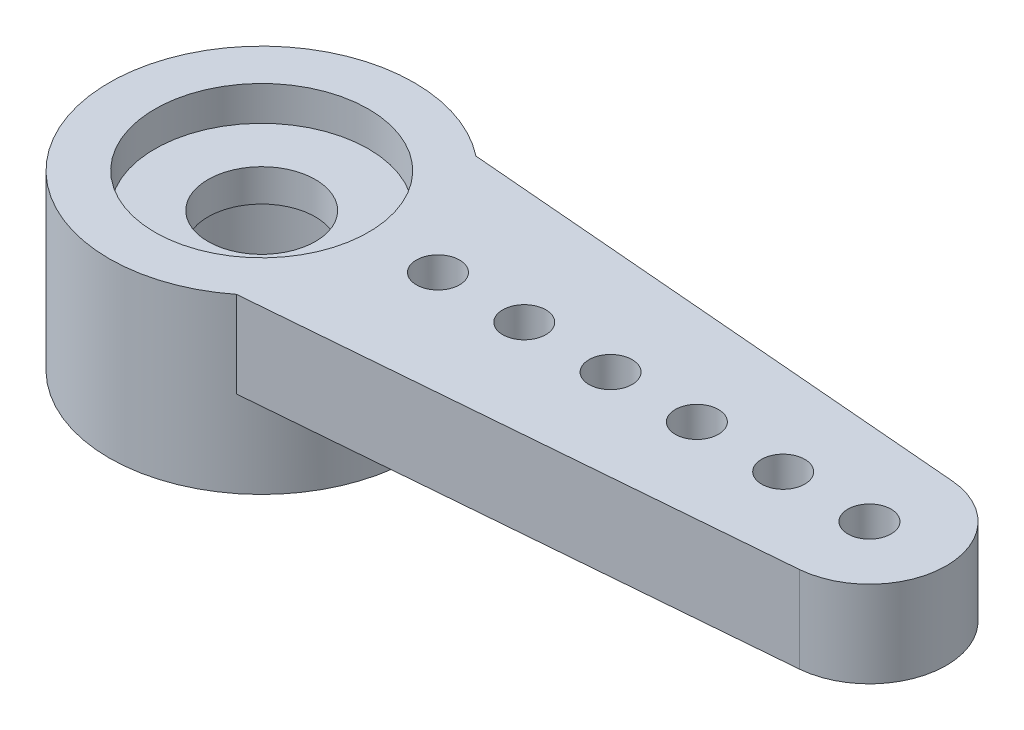
ISO-10303-21;
HEADER;
FILE_DESCRIPTION(('STEP AP214'),'2;1');
FILE_NAME('part.step','',(''),(''),'','','');
FILE_SCHEMA(('AUTOMOTIVE_DESIGN { 1 0 10303 214 1 1 1 1 }'));
ENDSEC;
DATA;
#1=APPLICATION_CONTEXT('core data for automotive mechanical design processes');
#2=APPLICATION_PROTOCOL_DEFINITION('international standard','automotive_design',2000,#1);
#3=PRODUCT_CONTEXT('',#1,'mechanical');
#4=PRODUCT('Part','Part','',(#3));
#5=PRODUCT_RELATED_PRODUCT_CATEGORY('part','',(#4));
#6=PRODUCT_DEFINITION_FORMATION('','',#4);
#7=PRODUCT_DEFINITION_CONTEXT('part definition',#1,'design');
#8=PRODUCT_DEFINITION('design','',#6,#7);
#9=PRODUCT_DEFINITION_SHAPE('','',#8);
#10=(LENGTH_UNIT() NAMED_UNIT(*) SI_UNIT(.MILLI.,.METRE.));
#11=(NAMED_UNIT(*) PLANE_ANGLE_UNIT() SI_UNIT($,.RADIAN.));
#12=(NAMED_UNIT(*) SI_UNIT($,.STERADIAN.) SOLID_ANGLE_UNIT());
#13=UNCERTAINTY_MEASURE_WITH_UNIT(LENGTH_MEASURE(1.E-05),#10,'distance_accuracy_value','');
#14=(GEOMETRIC_REPRESENTATION_CONTEXT(3) GLOBAL_UNCERTAINTY_ASSIGNED_CONTEXT((#13)) GLOBAL_UNIT_ASSIGNED_CONTEXT((#10,
#11,#12)) REPRESENTATION_CONTEXT('',''));
#15=CARTESIAN_POINT('',(0.,0.,0.));
#16=DIRECTION('',(0.,0.,1.));
#17=DIRECTION('',(1.,0.,0.));
#18=AXIS2_PLACEMENT_3D('',#15,#16,#17);
#19=CARTESIAN_POINT('',(0.,55.,0.));
#20=DIRECTION('',(0.,1.,0.));
#21=DIRECTION('',(0.,0.,1.));
#22=AXIS2_PLACEMENT_3D('',#19,#20,#21);
#23=CYLINDRICAL_SURFACE('',#22,3.535);
#24=CARTESIAN_POINT('',(0.,-2.,0.));
#25=DIRECTION('',(0.,1.,0.));
#26=DIRECTION('',(0.,0.,1.));
#27=AXIS2_PLACEMENT_3D('',#24,#25,#26);
#28=CIRCLE('',#27,3.535);
#29=CARTESIAN_POINT('',(0.,-2.,3.535));
#30=VERTEX_POINT('',#29);
#31=EDGE_CURVE('E150',#30,#30,#28,.T.);
#32=ORIENTED_EDGE('',*,*,#31,.T.);
#33=EDGE_LOOP('',(#32));
#34=FACE_BOUND('',#33,.T.);
#35=DIRECTION('',(0.,-1.,0.));
#36=VECTOR('',#35,1.);
#37=CARTESIAN_POINT('',(2.18988584177349,15.9538300204828,-2.775));
#38=LINE('',#37,#36);
#39=CARTESIAN_POINT('',(2.18988584177349,2.,-2.775));
#40=VERTEX_POINT('',#39);
#41=CARTESIAN_POINT('',(2.18988584177349,0.,-2.775));
#42=VERTEX_POINT('',#41);
#43=EDGE_CURVE('E96',#40,#42,#38,.T.);
#44=ORIENTED_EDGE('',*,*,#43,.T.);
#45=CARTESIAN_POINT('',(0.,0.,0.));
#46=DIRECTION('',(0.,1.,0.));
#47=DIRECTION('',(0.,0.,1.));
#48=AXIS2_PLACEMENT_3D('',#45,#46,#47);
#49=CIRCLE('',#48,3.535);
#50=CARTESIAN_POINT('',(2.18988584177349,0.,2.775));
#51=VERTEX_POINT('',#50);
#52=EDGE_CURVE('E101',#51,#42,#49,.T.);
#53=ORIENTED_EDGE('',*,*,#52,.F.);
#54=DIRECTION('',(0.,-1.,0.));
#55=VECTOR('',#54,1.);
#56=CARTESIAN_POINT('',(2.18988584177349,15.9538300204828,2.775));
#57=LINE('',#56,#55);
#58=CARTESIAN_POINT('',(2.18988584177349,2.,2.775));
#59=VERTEX_POINT('',#58);
#60=EDGE_CURVE('E110',#59,#51,#57,.T.);
#61=ORIENTED_EDGE('',*,*,#60,.F.);
#62=CARTESIAN_POINT('',(0.,2.,0.));
#63=DIRECTION('',(0.,1.,0.));
#64=DIRECTION('',(0.,0.,1.));
#65=AXIS2_PLACEMENT_3D('',#62,#63,#64);
#66=CIRCLE('',#65,3.535);
#67=EDGE_CURVE('E56',#40,#59,#66,.T.);
#68=ORIENTED_EDGE('',*,*,#67,.F.);
#69=EDGE_LOOP('',(#44,#53,#61,#68));
#70=FACE_BOUND('',#69,.T.);
#71=ADVANCED_FACE('F36',(#34,#70),#23,.T.);
#72=CARTESIAN_POINT('',(3.535,2.,0.));
#73=DIRECTION('',(0.,-1.,0.));
#74=DIRECTION('',(0.,0.,-1.));
#75=AXIS2_PLACEMENT_3D('',#72,#73,#74);
#76=PLANE('',#75);
#77=DIRECTION('',(-0.996562375684888,0.,-0.0828458289190973));
#78=VECTOR('',#77,1.);
#79=CARTESIAN_POINT('',(0.244137006312476,2.,-2.93675322195096));
#80=LINE('',#79,#78);
#81=CARTESIAN_POINT('',(14.232465575476,2.,-1.7738810287191));
#82=VERTEX_POINT('',#81);
#83=EDGE_CURVE('E95',#82,#40,#80,.T.);
#84=ORIENTED_EDGE('',*,*,#83,.T.);
#85=ORIENTED_EDGE('',*,*,#67,.T.);
#86=DIRECTION('',(-0.996562375684888,0.,0.0828458289190973));
#87=VECTOR('',#86,1.);
#88=CARTESIAN_POINT('',(0.244137006312476,2.,2.93675322195096));
#89=LINE('',#88,#87);
#90=CARTESIAN_POINT('',(14.232465575476,2.,1.7738810287191));
#91=VERTEX_POINT('',#90);
#92=EDGE_CURVE('E51',#91,#59,#89,.T.);
#93=ORIENTED_EDGE('',*,*,#92,.F.);
#94=CARTESIAN_POINT('',(14.085,2.,0.));
#95=DIRECTION('',(0.,-1.,0.));
#96=DIRECTION('',(0.,0.,-1.));
#97=AXIS2_PLACEMENT_3D('',#94,#95,#96);
#98=CIRCLE('',#97,1.78);
#99=EDGE_CURVE('E122',#82,#91,#98,.T.);
#100=ORIENTED_EDGE('',*,*,#99,.F.);
#101=EDGE_LOOP('',(#84,#85,#93,#100));
#102=FACE_BOUND('',#101,.T.);
#103=CARTESIAN_POINT('',(14.085,2.,0.));
#104=DIRECTION('',(0.,-1.,0.));
#105=DIRECTION('',(0.,0.,-1.));
#106=AXIS2_PLACEMENT_3D('',#103,#104,#105);
#107=CIRCLE('',#106,0.500000000000001);
#108=CARTESIAN_POINT('',(14.085,2.,-0.500000000000001));
#109=VERTEX_POINT('',#108);
#110=EDGE_CURVE('E119',#109,#109,#107,.T.);
#111=ORIENTED_EDGE('',*,*,#110,.T.);
#112=EDGE_LOOP('',(#111));
#113=FACE_BOUND('',#112,.T.);
#114=CARTESIAN_POINT('',(12.085,2.,0.));
#115=DIRECTION('',(0.,-1.,0.));
#116=DIRECTION('',(0.,0.,-1.));
#117=AXIS2_PLACEMENT_3D('',#114,#115,#116);
#118=CIRCLE('',#117,0.500000000000001);
#119=CARTESIAN_POINT('',(12.085,2.,-0.499999999999987));
#120=VERTEX_POINT('',#119);
#121=EDGE_CURVE('E116',#120,#120,#118,.T.);
#122=ORIENTED_EDGE('',*,*,#121,.T.);
#123=EDGE_LOOP('',(#122));
#124=FACE_BOUND('',#123,.T.);
#125=CARTESIAN_POINT('',(10.085,2.,0.));
#126=DIRECTION('',(0.,-1.,0.));
#127=DIRECTION('',(0.,0.,-1.));
#128=AXIS2_PLACEMENT_3D('',#125,#126,#127);
#129=CIRCLE('',#128,0.500000000000001);
#130=CARTESIAN_POINT('',(10.085,2.,-0.499999999999973));
#131=VERTEX_POINT('',#130);
#132=EDGE_CURVE('E113',#131,#131,#129,.T.);
#133=ORIENTED_EDGE('',*,*,#132,.T.);
#134=EDGE_LOOP('',(#133));
#135=FACE_BOUND('',#134,.T.);
#136=CARTESIAN_POINT('',(8.085,2.,0.));
#137=DIRECTION('',(0.,-1.,0.));
#138=DIRECTION('',(0.,0.,-1.));
#139=AXIS2_PLACEMENT_3D('',#136,#137,#138);
#140=CIRCLE('',#139,0.500000000000001);
#141=CARTESIAN_POINT('',(8.085,2.,-0.499999999999959));
#142=VERTEX_POINT('',#141);
#143=EDGE_CURVE('E109',#142,#142,#140,.T.);
#144=ORIENTED_EDGE('',*,*,#143,.T.);
#145=EDGE_LOOP('',(#144));
#146=FACE_BOUND('',#145,.T.);
#147=CARTESIAN_POINT('',(6.085,2.,0.));
#148=DIRECTION('',(0.,-1.,0.));
#149=DIRECTION('',(0.,0.,-1.));
#150=AXIS2_PLACEMENT_3D('',#147,#148,#149);
#151=CIRCLE('',#150,0.500000000000001);
#152=CARTESIAN_POINT('',(6.085,2.,-0.499999999999945));
#153=VERTEX_POINT('',#152);
#154=EDGE_CURVE('E106',#153,#153,#151,.T.);
#155=ORIENTED_EDGE('',*,*,#154,.T.);
#156=EDGE_LOOP('',(#155));
#157=FACE_BOUND('',#156,.T.);
#158=CARTESIAN_POINT('',(0.,2.,0.));
#159=DIRECTION('',(0.,1.,0.));
#160=DIRECTION('',(0.,0.,1.));
#161=AXIS2_PLACEMENT_3D('',#158,#159,#160);
#162=CIRCLE('',#161,2.475);
#163=CARTESIAN_POINT('',(0.,2.,2.475));
#164=VERTEX_POINT('',#163);
#165=EDGE_CURVE('E11',#164,#164,#162,.T.);
#166=ORIENTED_EDGE('',*,*,#165,.F.);
#167=EDGE_LOOP('',(#166));
#168=FACE_BOUND('',#167,.T.);
#169=CARTESIAN_POINT('',(4.085,2.,0.));
#170=DIRECTION('',(0.,-1.,0.));
#171=DIRECTION('',(0.,0.,-1.));
#172=AXIS2_PLACEMENT_3D('',#169,#170,#171);
#173=CIRCLE('',#172,0.500000000000001);
#174=CARTESIAN_POINT('',(4.085,2.,-0.499999999999931));
#175=VERTEX_POINT('',#174);
#176=EDGE_CURVE('E125',#175,#175,#173,.T.);
#177=ORIENTED_EDGE('',*,*,#176,.T.);
#178=EDGE_LOOP('',(#177));
#179=FACE_BOUND('',#178,.T.);
#180=ADVANCED_FACE('F38',(#102,#113,#124,#135,#146,#157,#168,#179),#76,.F.);
#181=CARTESIAN_POINT('',(0.,55.,0.));
#182=DIRECTION('',(0.,1.,0.));
#183=DIRECTION('',(0.,0.,1.));
#184=AXIS2_PLACEMENT_3D('',#181,#182,#183);
#185=CYLINDRICAL_SURFACE('',#184,2.475);
#186=CARTESIAN_POINT('',(0.,1.2,0.));
#187=DIRECTION('',(0.,1.,0.));
#188=DIRECTION('',(0.,0.,1.));
#189=AXIS2_PLACEMENT_3D('',#186,#187,#188);
#190=CIRCLE('',#189,2.475);
#191=CARTESIAN_POINT('',(0.,1.2,2.475));
#192=VERTEX_POINT('',#191);
#193=EDGE_CURVE('E44',#192,#192,#190,.T.);
#194=ORIENTED_EDGE('',*,*,#193,.F.);
#195=EDGE_LOOP('',(#194));
#196=FACE_BOUND('',#195,.T.);
#197=ORIENTED_EDGE('',*,*,#165,.T.);
#198=EDGE_LOOP('',(#197));
#199=FACE_BOUND('',#198,.T.);
#200=ADVANCED_FACE('F169',(#196,#199),#185,.F.);
#201=CARTESIAN_POINT('',(2.475,1.2,0.));
#202=DIRECTION('',(0.,-1.,0.));
#203=DIRECTION('',(0.,0.,-1.));
#204=AXIS2_PLACEMENT_3D('',#201,#202,#203);
#205=PLANE('',#204);
#206=CARTESIAN_POINT('',(0.,1.2,0.));
#207=DIRECTION('',(0.,1.,0.));
#208=DIRECTION('',(0.,0.,1.));
#209=AXIS2_PLACEMENT_3D('',#206,#207,#208);
#210=CIRCLE('',#209,1.245);
#211=CARTESIAN_POINT('',(0.,1.2,1.245));
#212=VERTEX_POINT('',#211);
#213=EDGE_CURVE('E162',#212,#212,#210,.T.);
#214=ORIENTED_EDGE('',*,*,#213,.F.);
#215=EDGE_LOOP('',(#214));
#216=FACE_BOUND('',#215,.T.);
#217=ORIENTED_EDGE('',*,*,#193,.T.);
#218=EDGE_LOOP('',(#217));
#219=FACE_BOUND('',#218,.T.);
#220=ADVANCED_FACE('F167',(#216,#219),#205,.F.);
#221=CARTESIAN_POINT('',(0.,55.,0.));
#222=DIRECTION('',(0.,1.,0.));
#223=DIRECTION('',(0.,0.,1.));
#224=AXIS2_PLACEMENT_3D('',#221,#222,#223);
#225=CYLINDRICAL_SURFACE('',#224,1.245);
#226=CARTESIAN_POINT('',(0.,0.449999999999999,0.));
#227=DIRECTION('',(0.,1.,0.));
#228=DIRECTION('',(0.,0.,1.));
#229=AXIS2_PLACEMENT_3D('',#226,#227,#228);
#230=CIRCLE('',#229,1.245);
#231=CARTESIAN_POINT('',(0.,0.449999999999999,1.245));
#232=VERTEX_POINT('',#231);
#233=EDGE_CURVE('E159',#232,#232,#230,.T.);
#234=ORIENTED_EDGE('',*,*,#233,.F.);
#235=EDGE_LOOP('',(#234));
#236=FACE_BOUND('',#235,.T.);
#237=ORIENTED_EDGE('',*,*,#213,.T.);
#238=EDGE_LOOP('',(#237));
#239=FACE_BOUND('',#238,.T.);
#240=ADVANCED_FACE('F207',(#236,#239),#225,.F.);
#241=CARTESIAN_POINT('',(1.245,0.45,0.));
#242=DIRECTION('',(0.,1.,0.));
#243=DIRECTION('',(0.,0.,1.));
#244=AXIS2_PLACEMENT_3D('',#241,#242,#243);
#245=PLANE('',#244);
#246=CARTESIAN_POINT('',(0.,0.449999999999999,0.));
#247=DIRECTION('',(0.,1.,0.));
#248=DIRECTION('',(0.,0.,1.));
#249=AXIS2_PLACEMENT_3D('',#246,#247,#248);
#250=CIRCLE('',#249,2.375);
#251=CARTESIAN_POINT('',(0.,0.449999999999999,2.375));
#252=VERTEX_POINT('',#251);
#253=EDGE_CURVE('E156',#252,#252,#250,.T.);
#254=ORIENTED_EDGE('',*,*,#253,.F.);
#255=EDGE_LOOP('',(#254));
#256=FACE_BOUND('',#255,.T.);
#257=ORIENTED_EDGE('',*,*,#233,.T.);
#258=EDGE_LOOP('',(#257));
#259=FACE_BOUND('',#258,.T.);
#260=ADVANCED_FACE('F203',(#256,#259),#245,.F.);
#261=CARTESIAN_POINT('',(0.,55.,0.));
#262=DIRECTION('',(0.,1.,0.));
#263=DIRECTION('',(0.,0.,1.));
#264=AXIS2_PLACEMENT_3D('',#261,#262,#263);
#265=CYLINDRICAL_SURFACE('',#264,2.375);
#266=CARTESIAN_POINT('',(0.,-2.,0.));
#267=DIRECTION('',(0.,1.,0.));
#268=DIRECTION('',(0.,0.,1.));
#269=AXIS2_PLACEMENT_3D('',#266,#267,#268);
#270=CIRCLE('',#269,2.375);
#271=CARTESIAN_POINT('',(0.,-2.,2.375));
#272=VERTEX_POINT('',#271);
#273=EDGE_CURVE('E153',#272,#272,#270,.T.);
#274=ORIENTED_EDGE('',*,*,#273,.F.);
#275=EDGE_LOOP('',(#274));
#276=FACE_BOUND('',#275,.T.);
#277=ORIENTED_EDGE('',*,*,#253,.T.);
#278=EDGE_LOOP('',(#277));
#279=FACE_BOUND('',#278,.T.);
#280=ADVANCED_FACE('F190',(#276,#279),#265,.F.);
#281=CARTESIAN_POINT('',(2.375,-2.,0.));
#282=DIRECTION('',(0.,1.,0.));
#283=DIRECTION('',(0.,0.,1.));
#284=AXIS2_PLACEMENT_3D('',#281,#282,#283);
#285=PLANE('',#284);
#286=ORIENTED_EDGE('',*,*,#31,.F.);
#287=EDGE_LOOP('',(#286));
#288=FACE_BOUND('',#287,.T.);
#289=ORIENTED_EDGE('',*,*,#273,.T.);
#290=EDGE_LOOP('',(#289));
#291=FACE_BOUND('',#290,.T.);
#292=ADVANCED_FACE('F181',(#288,#291),#285,.F.);
#293=CARTESIAN_POINT('',(4.085,15.9538300204828,0.));
#294=DIRECTION('',(0.,-1.,0.));
#295=DIRECTION('',(0.,0.,-1.));
#296=AXIS2_PLACEMENT_3D('',#293,#294,#295);
#297=CYLINDRICAL_SURFACE('',#296,0.500000000000001);
#298=CARTESIAN_POINT('',(4.085,0.,0.));
#299=DIRECTION('',(0.,1.,0.));
#300=DIRECTION('',(0.,0.,1.));
#301=AXIS2_PLACEMENT_3D('',#298,#299,#300);
#302=CIRCLE('',#301,0.500000000000001);
#303=CARTESIAN_POINT('',(4.085,0.,0.500000000000071));
#304=VERTEX_POINT('',#303);
#305=EDGE_CURVE('E128',#304,#304,#302,.T.);
#306=ORIENTED_EDGE('',*,*,#305,.F.);
#307=EDGE_LOOP('',(#306));
#308=FACE_BOUND('',#307,.T.);
#309=ORIENTED_EDGE('',*,*,#176,.F.);
#310=EDGE_LOOP('',(#309));
#311=FACE_BOUND('',#310,.T.);
#312=ADVANCED_FACE('F178',(#308,#311),#297,.F.);
#313=CARTESIAN_POINT('',(0.244137006312476,15.9538300204828,2.93675322195096));
#314=DIRECTION('',(-0.0828458289190973,0.,-0.996562375684888));
#315=DIRECTION('',(-0.996562375684888,0.,0.0828458289190973));
#316=AXIS2_PLACEMENT_3D('',#313,#314,#315);
#317=PLANE('',#316);
#318=DIRECTION('',(0.,-1.,0.));
#319=VECTOR('',#318,1.);
#320=CARTESIAN_POINT('',(14.232465575476,15.9538300204828,1.7738810287191));
#321=LINE('',#320,#319);
#322=CARTESIAN_POINT('',(14.232465575476,0.,1.7738810287191));
#323=VERTEX_POINT('',#322);
#324=EDGE_CURVE('E81',#91,#323,#321,.T.);
#325=ORIENTED_EDGE('',*,*,#324,.F.);
#326=ORIENTED_EDGE('',*,*,#92,.T.);
#327=ORIENTED_EDGE('',*,*,#60,.T.);
#328=DIRECTION('',(0.996562375684888,0.,-0.0828458289190973));
#329=VECTOR('',#328,1.);
#330=CARTESIAN_POINT('',(0.244137006312476,0.,2.93675322195096));
#331=LINE('',#330,#329);
#332=EDGE_CURVE('E87',#51,#323,#331,.T.);
#333=ORIENTED_EDGE('',*,*,#332,.T.);
#334=EDGE_LOOP('',(#325,#326,#327,#333));
#335=FACE_BOUND('',#334,.T.);
#336=ADVANCED_FACE('F180',(#335),#317,.F.);
#337=CARTESIAN_POINT('',(14.085,15.9538300204828,0.));
#338=DIRECTION('',(0.,-1.,0.));
#339=DIRECTION('',(0.,0.,-1.));
#340=AXIS2_PLACEMENT_3D('',#337,#338,#339);
#341=CYLINDRICAL_SURFACE('',#340,1.78);
#342=CARTESIAN_POINT('',(14.085,0.,0.));
#343=DIRECTION('',(0.,1.,0.));
#344=DIRECTION('',(0.,0.,1.));
#345=AXIS2_PLACEMENT_3D('',#342,#343,#344);
#346=CIRCLE('',#345,1.78);
#347=CARTESIAN_POINT('',(14.232465575476,0.,-1.7738810287191));
#348=VERTEX_POINT('',#347);
#349=EDGE_CURVE('E75',#323,#348,#346,.T.);
#350=ORIENTED_EDGE('',*,*,#349,.T.);
#351=DIRECTION('',(0.,-1.,0.));
#352=VECTOR('',#351,1.);
#353=CARTESIAN_POINT('',(14.232465575476,15.9538300204828,-1.7738810287191));
#354=LINE('',#353,#352);
#355=EDGE_CURVE('E78',#82,#348,#354,.T.);
#356=ORIENTED_EDGE('',*,*,#355,.F.);
#357=ORIENTED_EDGE('',*,*,#99,.T.);
#358=ORIENTED_EDGE('',*,*,#324,.T.);
#359=EDGE_LOOP('',(#350,#356,#357,#358));
#360=FACE_BOUND('',#359,.T.);
#361=ADVANCED_FACE('F77',(#360),#341,.T.);
#362=CARTESIAN_POINT('',(14.085,15.9538300204828,0.));
#363=DIRECTION('',(0.,-1.,0.));
#364=DIRECTION('',(0.,0.,-1.));
#365=AXIS2_PLACEMENT_3D('',#362,#363,#364);
#366=CYLINDRICAL_SURFACE('',#365,0.500000000000001);
#367=CARTESIAN_POINT('',(14.085,0.,0.));
#368=DIRECTION('',(0.,1.,0.));
#369=DIRECTION('',(0.,0.,1.));
#370=AXIS2_PLACEMENT_3D('',#367,#368,#369);
#371=CIRCLE('',#370,0.500000000000001);
#372=CARTESIAN_POINT('',(14.085,0.,0.500000000000001));
#373=VERTEX_POINT('',#372);
#374=EDGE_CURVE('E86',#373,#373,#371,.T.);
#375=ORIENTED_EDGE('',*,*,#374,.F.);
#376=EDGE_LOOP('',(#375));
#377=FACE_BOUND('',#376,.T.);
#378=ORIENTED_EDGE('',*,*,#110,.F.);
#379=EDGE_LOOP('',(#378));
#380=FACE_BOUND('',#379,.T.);
#381=ADVANCED_FACE('F269',(#377,#380),#366,.F.);
#382=CARTESIAN_POINT('',(12.085,15.9538300204828,0.));
#383=DIRECTION('',(0.,-1.,0.));
#384=DIRECTION('',(0.,0.,-1.));
#385=AXIS2_PLACEMENT_3D('',#382,#383,#384);
#386=CYLINDRICAL_SURFACE('',#385,0.500000000000001);
#387=CARTESIAN_POINT('',(12.085,0.,0.));
#388=DIRECTION('',(0.,1.,0.));
#389=DIRECTION('',(0.,0.,1.));
#390=AXIS2_PLACEMENT_3D('',#387,#388,#389);
#391=CIRCLE('',#390,0.500000000000001);
#392=CARTESIAN_POINT('',(12.085,0.,0.500000000000015));
#393=VERTEX_POINT('',#392);
#394=EDGE_CURVE('E135',#393,#393,#391,.T.);
#395=ORIENTED_EDGE('',*,*,#394,.F.);
#396=EDGE_LOOP('',(#395));
#397=FACE_BOUND('',#396,.T.);
#398=ORIENTED_EDGE('',*,*,#121,.F.);
#399=EDGE_LOOP('',(#398));
#400=FACE_BOUND('',#399,.T.);
#401=ADVANCED_FACE('F278',(#397,#400),#386,.F.);
#402=CARTESIAN_POINT('',(10.085,15.9538300204828,0.));
#403=DIRECTION('',(0.,-1.,0.));
#404=DIRECTION('',(0.,0.,-1.));
#405=AXIS2_PLACEMENT_3D('',#402,#403,#404);
#406=CYLINDRICAL_SURFACE('',#405,0.500000000000001);
#407=CARTESIAN_POINT('',(10.085,0.,0.));
#408=DIRECTION('',(0.,1.,0.));
#409=DIRECTION('',(0.,0.,1.));
#410=AXIS2_PLACEMENT_3D('',#407,#408,#409);
#411=CIRCLE('',#410,0.500000000000001);
#412=CARTESIAN_POINT('',(10.085,0.,0.500000000000029));
#413=VERTEX_POINT('',#412);
#414=EDGE_CURVE('E138',#413,#413,#411,.T.);
#415=ORIENTED_EDGE('',*,*,#414,.F.);
#416=EDGE_LOOP('',(#415));
#417=FACE_BOUND('',#416,.T.);
#418=ORIENTED_EDGE('',*,*,#132,.F.);
#419=EDGE_LOOP('',(#418));
#420=FACE_BOUND('',#419,.T.);
#421=ADVANCED_FACE('F289',(#417,#420),#406,.F.);
#422=CARTESIAN_POINT('',(8.085,15.9538300204828,0.));
#423=DIRECTION('',(0.,-1.,0.));
#424=DIRECTION('',(0.,0.,-1.));
#425=AXIS2_PLACEMENT_3D('',#422,#423,#424);
#426=CYLINDRICAL_SURFACE('',#425,0.500000000000001);
#427=CARTESIAN_POINT('',(8.085,0.,0.));
#428=DIRECTION('',(0.,1.,0.));
#429=DIRECTION('',(0.,0.,1.));
#430=AXIS2_PLACEMENT_3D('',#427,#428,#429);
#431=CIRCLE('',#430,0.500000000000001);
#432=CARTESIAN_POINT('',(8.085,0.,0.500000000000043));
#433=VERTEX_POINT('',#432);
#434=EDGE_CURVE('E141',#433,#433,#431,.T.);
#435=ORIENTED_EDGE('',*,*,#434,.F.);
#436=EDGE_LOOP('',(#435));
#437=FACE_BOUND('',#436,.T.);
#438=ORIENTED_EDGE('',*,*,#143,.F.);
#439=EDGE_LOOP('',(#438));
#440=FACE_BOUND('',#439,.T.);
#441=ADVANCED_FACE('F300',(#437,#440),#426,.F.);
#442=CARTESIAN_POINT('',(6.085,15.9538300204828,0.));
#443=DIRECTION('',(0.,-1.,0.));
#444=DIRECTION('',(0.,0.,-1.));
#445=AXIS2_PLACEMENT_3D('',#442,#443,#444);
#446=CYLINDRICAL_SURFACE('',#445,0.500000000000001);
#447=CARTESIAN_POINT('',(6.085,0.,0.));
#448=DIRECTION('',(0.,1.,0.));
#449=DIRECTION('',(0.,0.,1.));
#450=AXIS2_PLACEMENT_3D('',#447,#448,#449);
#451=CIRCLE('',#450,0.500000000000001);
#452=CARTESIAN_POINT('',(6.085,0.,0.500000000000057));
#453=VERTEX_POINT('',#452);
#454=EDGE_CURVE('E144',#453,#453,#451,.T.);
#455=ORIENTED_EDGE('',*,*,#454,.F.);
#456=EDGE_LOOP('',(#455));
#457=FACE_BOUND('',#456,.T.);
#458=ORIENTED_EDGE('',*,*,#154,.F.);
#459=EDGE_LOOP('',(#458));
#460=FACE_BOUND('',#459,.T.);
#461=ADVANCED_FACE('F311',(#457,#460),#446,.F.);
#462=CARTESIAN_POINT('',(0.,0.,0.));
#463=DIRECTION('',(0.,1.,0.));
#464=DIRECTION('',(0.,0.,1.));
#465=AXIS2_PLACEMENT_3D('',#462,#463,#464);
#466=PLANE('',#465);
#467=ORIENTED_EDGE('',*,*,#305,.T.);
#468=EDGE_LOOP('',(#467));
#469=FACE_BOUND('',#468,.T.);
#470=DIRECTION('',(0.996562375684888,0.,0.0828458289190973));
#471=VECTOR('',#470,1.);
#472=CARTESIAN_POINT('',(0.244137006312476,0.,-2.93675322195096));
#473=LINE('',#472,#471);
#474=EDGE_CURVE('E93',#42,#348,#473,.T.);
#475=ORIENTED_EDGE('',*,*,#474,.T.);
#476=ORIENTED_EDGE('',*,*,#349,.F.);
#477=ORIENTED_EDGE('',*,*,#332,.F.);
#478=ORIENTED_EDGE('',*,*,#52,.T.);
#479=EDGE_LOOP('',(#475,#476,#477,#478));
#480=FACE_BOUND('',#479,.T.);
#481=ORIENTED_EDGE('',*,*,#374,.T.);
#482=EDGE_LOOP('',(#481));
#483=FACE_BOUND('',#482,.T.);
#484=ORIENTED_EDGE('',*,*,#394,.T.);
#485=EDGE_LOOP('',(#484));
#486=FACE_BOUND('',#485,.T.);
#487=ORIENTED_EDGE('',*,*,#414,.T.);
#488=EDGE_LOOP('',(#487));
#489=FACE_BOUND('',#488,.T.);
#490=ORIENTED_EDGE('',*,*,#434,.T.);
#491=EDGE_LOOP('',(#490));
#492=FACE_BOUND('',#491,.T.);
#493=ORIENTED_EDGE('',*,*,#454,.T.);
#494=EDGE_LOOP('',(#493));
#495=FACE_BOUND('',#494,.T.);
#496=ADVANCED_FACE('F98',(#469,#480,#483,#486,#489,#492,#495),#466,.F.);
#497=CARTESIAN_POINT('',(0.244137006312476,15.9538300204828,-2.93675322195096));
#498=DIRECTION('',(0.0828458289190973,0.,-0.996562375684888));
#499=DIRECTION('',(-0.996562375684888,0.,-0.0828458289190973));
#500=AXIS2_PLACEMENT_3D('',#497,#498,#499);
#501=PLANE('',#500);
#502=ORIENTED_EDGE('',*,*,#83,.F.);
#503=ORIENTED_EDGE('',*,*,#355,.T.);
#504=ORIENTED_EDGE('',*,*,#474,.F.);
#505=ORIENTED_EDGE('',*,*,#43,.F.);
#506=EDGE_LOOP('',(#502,#503,#504,#505));
#507=FACE_BOUND('',#506,.T.);
#508=ADVANCED_FACE('F91',(#507),#501,.T.);
#509=CLOSED_SHELL('',(#71,#180,#200,#220,#240,#260,#280,#292,#312,#336,#361,#381,#401,#421,#441,
#461,#496,#508));
#510=MANIFOLD_SOLID_BREP('B2',#509);
#511=ADVANCED_BREP_SHAPE_REPRESENTATION('',(#18,#510),#14);
#512=SHAPE_DEFINITION_REPRESENTATION(#9,#511);
ENDSEC;
END-ISO-10303-21;
